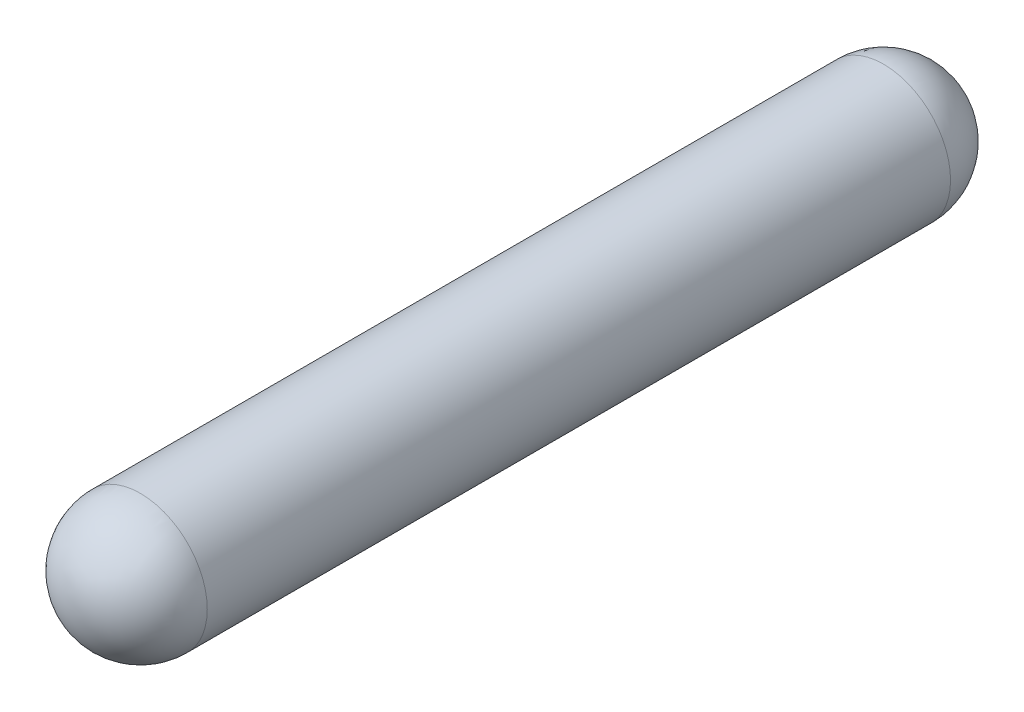
ISO-10303-21;
HEADER;
FILE_DESCRIPTION(('STEP AP214'),'2;1');
FILE_NAME('part.step','',(''),(''),'','','');
FILE_SCHEMA(('AUTOMOTIVE_DESIGN { 1 0 10303 214 1 1 1 1 }'));
ENDSEC;
DATA;
#1=APPLICATION_CONTEXT('core data for automotive mechanical design processes');
#2=APPLICATION_PROTOCOL_DEFINITION('international standard','automotive_design',2000,#1);
#3=PRODUCT_CONTEXT('',#1,'mechanical');
#4=PRODUCT('Part','Part','',(#3));
#5=PRODUCT_RELATED_PRODUCT_CATEGORY('part','',(#4));
#6=PRODUCT_DEFINITION_FORMATION('','',#4);
#7=PRODUCT_DEFINITION_CONTEXT('part definition',#1,'design');
#8=PRODUCT_DEFINITION('design','',#6,#7);
#9=PRODUCT_DEFINITION_SHAPE('','',#8);
#10=(LENGTH_UNIT() NAMED_UNIT(*) SI_UNIT(.MILLI.,.METRE.));
#11=(NAMED_UNIT(*) PLANE_ANGLE_UNIT() SI_UNIT($,.RADIAN.));
#12=(NAMED_UNIT(*) SI_UNIT($,.STERADIAN.) SOLID_ANGLE_UNIT());
#13=UNCERTAINTY_MEASURE_WITH_UNIT(LENGTH_MEASURE(1.E-05),#10,'distance_accuracy_value','');
#14=(GEOMETRIC_REPRESENTATION_CONTEXT(3) GLOBAL_UNCERTAINTY_ASSIGNED_CONTEXT((#13)) GLOBAL_UNIT_ASSIGNED_CONTEXT((#10,
#11,#12)) REPRESENTATION_CONTEXT('',''));
#15=CARTESIAN_POINT('',(0.,0.,0.));
#16=DIRECTION('',(0.,0.,1.));
#17=DIRECTION('',(1.,0.,0.));
#18=AXIS2_PLACEMENT_3D('',#15,#16,#17);
#19=CARTESIAN_POINT('',(0.,0.,-3.));
#20=DIRECTION('',(1.,0.,0.));
#21=DIRECTION('',(0.,-1.,0.));
#22=AXIS2_PLACEMENT_3D('',#19,#20,#21);
#23=SPHERICAL_SURFACE('',#22,0.585);
#24=CARTESIAN_POINT('',(0.,0.,-3.));
#25=DIRECTION('',(0.,0.,1.));
#26=DIRECTION('',(1.,0.,0.));
#27=AXIS2_PLACEMENT_3D('',#24,#25,#26);
#28=CIRCLE('',#27,0.585);
#29=CARTESIAN_POINT('',(0.585,0.,-3.));
#30=VERTEX_POINT('',#29);
#31=CARTESIAN_POINT('',(-0.585,0.,-3.));
#32=VERTEX_POINT('',#31);
#33=EDGE_CURVE('E42',#30,#32,#28,.T.);
#34=ORIENTED_EDGE('',*,*,#33,.F.);
#35=CARTESIAN_POINT('',(0.,0.,-3.));
#36=DIRECTION('',(0.,0.,1.));
#37=DIRECTION('',(1.,0.,0.));
#38=AXIS2_PLACEMENT_3D('',#35,#36,#37);
#39=CIRCLE('',#38,0.585);
#40=EDGE_CURVE('E26',#32,#30,#39,.T.);
#41=ORIENTED_EDGE('',*,*,#40,.F.);
#42=EDGE_LOOP('',(#34,#41));
#43=FACE_BOUND('',#42,.T.);
#44=ADVANCED_FACE('F17',(#43),#23,.T.);
#45=CARTESIAN_POINT('',(0.,0.,3.5));
#46=DIRECTION('',(1.,0.,0.));
#47=DIRECTION('',(0.,1.,0.));
#48=AXIS2_PLACEMENT_3D('',#45,#46,#47);
#49=SPHERICAL_SURFACE('',#48,0.585);
#50=CARTESIAN_POINT('',(0.,0.,3.5));
#51=DIRECTION('',(0.,0.,1.));
#52=DIRECTION('',(1.,0.,0.));
#53=AXIS2_PLACEMENT_3D('',#50,#51,#52);
#54=CIRCLE('',#53,0.585);
#55=CARTESIAN_POINT('',(0.585,0.,3.5));
#56=VERTEX_POINT('',#55);
#57=CARTESIAN_POINT('',(-0.585,0.,3.5));
#58=VERTEX_POINT('',#57);
#59=EDGE_CURVE('E11',#56,#58,#54,.F.);
#60=ORIENTED_EDGE('',*,*,#59,.F.);
#61=CARTESIAN_POINT('',(0.,0.,3.5));
#62=DIRECTION('',(0.,0.,1.));
#63=DIRECTION('',(1.,0.,0.));
#64=AXIS2_PLACEMENT_3D('',#61,#62,#63);
#65=CIRCLE('',#64,0.585);
#66=EDGE_CURVE('E34',#58,#56,#65,.F.);
#67=ORIENTED_EDGE('',*,*,#66,.F.);
#68=EDGE_LOOP('',(#60,#67));
#69=FACE_BOUND('',#68,.T.);
#70=ADVANCED_FACE('F49',(#69),#49,.T.);
#71=CARTESIAN_POINT('',(0.,0.,-3.));
#72=DIRECTION('',(0.,0.,1.));
#73=DIRECTION('',(1.,0.,0.));
#74=AXIS2_PLACEMENT_3D('',#71,#72,#73);
#75=CYLINDRICAL_SURFACE('',#74,0.585);
#76=ORIENTED_EDGE('',*,*,#66,.T.);
#77=ORIENTED_EDGE('',*,*,#59,.T.);
#78=EDGE_LOOP('',(#76,#77));
#79=FACE_BOUND('',#78,.T.);
#80=ORIENTED_EDGE('',*,*,#40,.T.);
#81=ORIENTED_EDGE('',*,*,#33,.T.);
#82=EDGE_LOOP('',(#80,#81));
#83=FACE_BOUND('',#82,.T.);
#84=ADVANCED_FACE('F45',(#79,#83),#75,.T.);
#85=CLOSED_SHELL('',(#44,#70,#84));
#86=MANIFOLD_SOLID_BREP('B1',#85);
#87=ADVANCED_BREP_SHAPE_REPRESENTATION('',(#18,#86),#14);
#88=SHAPE_DEFINITION_REPRESENTATION(#9,#87);
ENDSEC;
END-ISO-10303-21;
